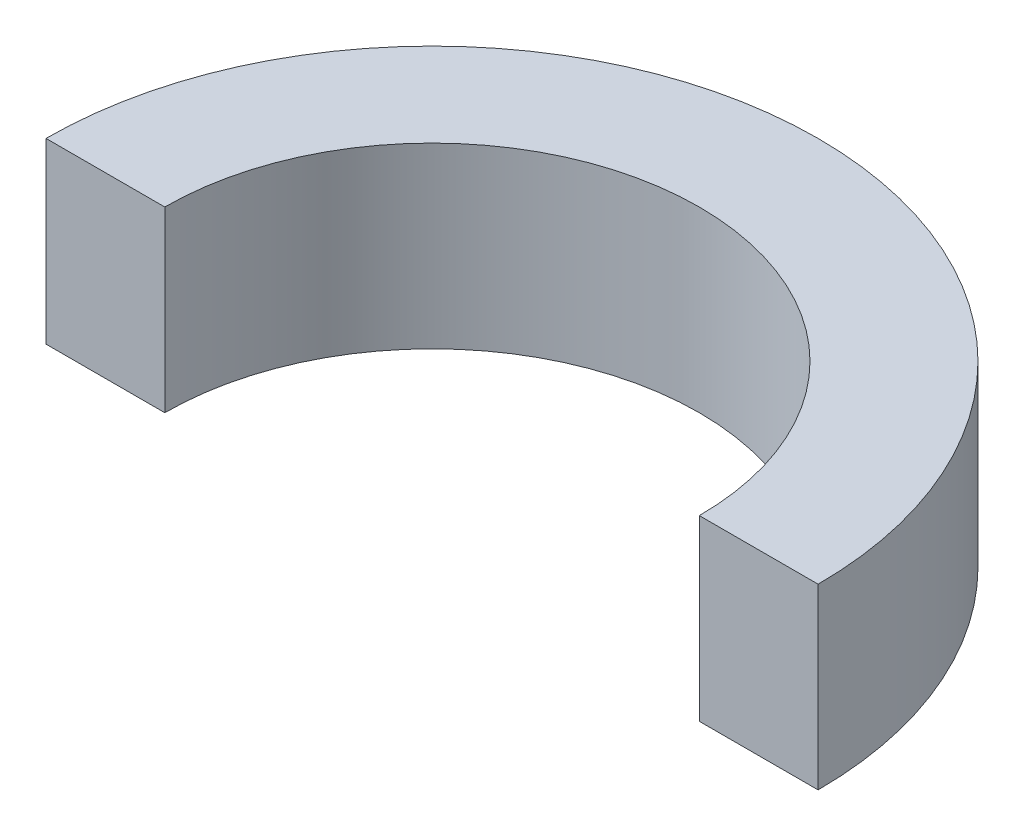
ISO-10303-21;
HEADER;
FILE_DESCRIPTION(('STEP AP214'),'2;1');
FILE_NAME('part.step','',(''),(''),'','','');
FILE_SCHEMA(('AUTOMOTIVE_DESIGN { 1 0 10303 214 1 1 1 1 }'));
ENDSEC;
DATA;
#1=APPLICATION_CONTEXT('core data for automotive mechanical design processes');
#2=APPLICATION_PROTOCOL_DEFINITION('international standard','automotive_design',2000,#1);
#3=PRODUCT_CONTEXT('',#1,'mechanical');
#4=PRODUCT('Part','Part','',(#3));
#5=PRODUCT_RELATED_PRODUCT_CATEGORY('part','',(#4));
#6=PRODUCT_DEFINITION_FORMATION('','',#4);
#7=PRODUCT_DEFINITION_CONTEXT('part definition',#1,'design');
#8=PRODUCT_DEFINITION('design','',#6,#7);
#9=PRODUCT_DEFINITION_SHAPE('','',#8);
#10=(LENGTH_UNIT() NAMED_UNIT(*) SI_UNIT(.MILLI.,.METRE.));
#11=(NAMED_UNIT(*) PLANE_ANGLE_UNIT() SI_UNIT($,.RADIAN.));
#12=(NAMED_UNIT(*) SI_UNIT($,.STERADIAN.) SOLID_ANGLE_UNIT());
#13=UNCERTAINTY_MEASURE_WITH_UNIT(LENGTH_MEASURE(1.E-05),#10,'distance_accuracy_value','');
#14=(GEOMETRIC_REPRESENTATION_CONTEXT(3) GLOBAL_UNCERTAINTY_ASSIGNED_CONTEXT((#13)) GLOBAL_UNIT_ASSIGNED_CONTEXT((#10,
#11,#12)) REPRESENTATION_CONTEXT('',''));
#15=CARTESIAN_POINT('',(0.,0.,0.));
#16=DIRECTION('',(0.,0.,1.));
#17=DIRECTION('',(1.,0.,0.));
#18=AXIS2_PLACEMENT_3D('',#15,#16,#17);
#19=CARTESIAN_POINT('',(0.,6.,0.));
#20=DIRECTION('',(0.,-1.,0.));
#21=DIRECTION('',(0.,0.,-1.));
#22=AXIS2_PLACEMENT_3D('',#19,#20,#21);
#23=CYLINDRICAL_SURFACE('',#22,9.);
#24=CARTESIAN_POINT('',(0.,0.,0.));
#25=DIRECTION('',(0.,-1.,0.));
#26=DIRECTION('',(0.,0.,1.));
#27=AXIS2_PLACEMENT_3D('',#24,#25,#26);
#28=CIRCLE('',#27,9.);
#29=CARTESIAN_POINT('',(-9.,0.,0.));
#30=VERTEX_POINT('',#29);
#31=CARTESIAN_POINT('',(9.,0.,0.));
#32=VERTEX_POINT('',#31);
#33=EDGE_CURVE('E107',#30,#32,#28,.T.);
#34=ORIENTED_EDGE('',*,*,#33,.T.);
#35=DIRECTION('',(0.,-1.,0.));
#36=VECTOR('',#35,1.);
#37=CARTESIAN_POINT('',(9.,6.,0.));
#38=LINE('',#37,#36);
#39=CARTESIAN_POINT('',(9.,6.,0.));
#40=VERTEX_POINT('',#39);
#41=EDGE_CURVE('E11',#40,#32,#38,.T.);
#42=ORIENTED_EDGE('',*,*,#41,.F.);
#43=CARTESIAN_POINT('',(0.,6.,0.));
#44=DIRECTION('',(0.,-1.,0.));
#45=DIRECTION('',(0.,0.,1.));
#46=AXIS2_PLACEMENT_3D('',#43,#44,#45);
#47=CIRCLE('',#46,9.);
#48=CARTESIAN_POINT('',(-9.,6.,0.));
#49=VERTEX_POINT('',#48);
#50=EDGE_CURVE('E91',#49,#40,#47,.T.);
#51=ORIENTED_EDGE('',*,*,#50,.F.);
#52=DIRECTION('',(0.,-1.,0.));
#53=VECTOR('',#52,1.);
#54=CARTESIAN_POINT('',(-9.,6.,0.));
#55=LINE('',#54,#53);
#56=EDGE_CURVE('E103',#49,#30,#55,.T.);
#57=ORIENTED_EDGE('',*,*,#56,.T.);
#58=EDGE_LOOP('',(#34,#42,#51,#57));
#59=FACE_BOUND('',#58,.T.);
#60=ADVANCED_FACE('F39',(#59),#23,.F.);
#61=CARTESIAN_POINT('',(9.,6.,0.));
#62=DIRECTION('',(0.,0.,-1.));
#63=DIRECTION('',(-1.,0.,0.));
#64=AXIS2_PLACEMENT_3D('',#61,#62,#63);
#65=PLANE('',#64);
#66=DIRECTION('',(1.,0.,0.));
#67=VECTOR('',#66,1.);
#68=CARTESIAN_POINT('',(9.,0.,0.));
#69=LINE('',#68,#67);
#70=CARTESIAN_POINT('',(13.,0.,0.));
#71=VERTEX_POINT('',#70);
#72=EDGE_CURVE('E96',#32,#71,#69,.T.);
#73=ORIENTED_EDGE('',*,*,#72,.T.);
#74=DIRECTION('',(0.,-1.,0.));
#75=VECTOR('',#74,1.);
#76=CARTESIAN_POINT('',(13.,6.,0.));
#77=LINE('',#76,#75);
#78=CARTESIAN_POINT('',(13.,6.,0.));
#79=VERTEX_POINT('',#78);
#80=EDGE_CURVE('E48',#79,#71,#77,.T.);
#81=ORIENTED_EDGE('',*,*,#80,.F.);
#82=DIRECTION('',(1.,0.,0.));
#83=VECTOR('',#82,1.);
#84=CARTESIAN_POINT('',(9.,6.,0.));
#85=LINE('',#84,#83);
#86=EDGE_CURVE('E86',#40,#79,#85,.T.);
#87=ORIENTED_EDGE('',*,*,#86,.F.);
#88=ORIENTED_EDGE('',*,*,#41,.T.);
#89=EDGE_LOOP('',(#73,#81,#87,#88));
#90=FACE_BOUND('',#89,.T.);
#91=ADVANCED_FACE('F95',(#90),#65,.F.);
#92=CARTESIAN_POINT('',(0.,6.,0.));
#93=DIRECTION('',(0.,-1.,0.));
#94=DIRECTION('',(0.,0.,-1.));
#95=AXIS2_PLACEMENT_3D('',#92,#93,#94);
#96=CYLINDRICAL_SURFACE('',#95,13.);
#97=CARTESIAN_POINT('',(0.,0.,0.));
#98=DIRECTION('',(0.,1.,0.));
#99=DIRECTION('',(0.,0.,1.));
#100=AXIS2_PLACEMENT_3D('',#97,#98,#99);
#101=CIRCLE('',#100,13.);
#102=CARTESIAN_POINT('',(-13.,0.,0.));
#103=VERTEX_POINT('',#102);
#104=EDGE_CURVE('E73',#71,#103,#101,.T.);
#105=ORIENTED_EDGE('',*,*,#104,.T.);
#106=DIRECTION('',(0.,-1.,0.));
#107=VECTOR('',#106,1.);
#108=CARTESIAN_POINT('',(-13.,6.,0.));
#109=LINE('',#108,#107);
#110=CARTESIAN_POINT('',(-13.,6.,0.));
#111=VERTEX_POINT('',#110);
#112=EDGE_CURVE('E98',#111,#103,#109,.T.);
#113=ORIENTED_EDGE('',*,*,#112,.F.);
#114=CARTESIAN_POINT('',(0.,6.,0.));
#115=DIRECTION('',(0.,1.,0.));
#116=DIRECTION('',(0.,0.,1.));
#117=AXIS2_PLACEMENT_3D('',#114,#115,#116);
#118=CIRCLE('',#117,13.);
#119=EDGE_CURVE('E89',#79,#111,#118,.T.);
#120=ORIENTED_EDGE('',*,*,#119,.F.);
#121=ORIENTED_EDGE('',*,*,#80,.T.);
#122=EDGE_LOOP('',(#105,#113,#120,#121));
#123=FACE_BOUND('',#122,.T.);
#124=ADVANCED_FACE('F99',(#123),#96,.T.);
#125=CARTESIAN_POINT('',(-13.,6.,0.));
#126=DIRECTION('',(0.,0.,-1.));
#127=DIRECTION('',(-1.,0.,0.));
#128=AXIS2_PLACEMENT_3D('',#125,#126,#127);
#129=PLANE('',#128);
#130=DIRECTION('',(1.,0.,0.));
#131=VECTOR('',#130,1.);
#132=CARTESIAN_POINT('',(-13.,0.,0.));
#133=LINE('',#132,#131);
#134=EDGE_CURVE('E79',#103,#30,#133,.T.);
#135=ORIENTED_EDGE('',*,*,#134,.T.);
#136=ORIENTED_EDGE('',*,*,#56,.F.);
#137=DIRECTION('',(1.,0.,0.));
#138=VECTOR('',#137,1.);
#139=CARTESIAN_POINT('',(-13.,6.,0.));
#140=LINE('',#139,#138);
#141=EDGE_CURVE('E56',#111,#49,#140,.T.);
#142=ORIENTED_EDGE('',*,*,#141,.F.);
#143=ORIENTED_EDGE('',*,*,#112,.T.);
#144=EDGE_LOOP('',(#135,#136,#142,#143));
#145=FACE_BOUND('',#144,.T.);
#146=ADVANCED_FACE('F120',(#145),#129,.F.);
#147=CARTESIAN_POINT('',(0.,6.,0.));
#148=DIRECTION('',(0.,1.,0.));
#149=DIRECTION('',(0.,0.,1.));
#150=AXIS2_PLACEMENT_3D('',#147,#148,#149);
#151=PLANE('',#150);
#152=ORIENTED_EDGE('',*,*,#50,.T.);
#153=ORIENTED_EDGE('',*,*,#86,.T.);
#154=ORIENTED_EDGE('',*,*,#119,.T.);
#155=ORIENTED_EDGE('',*,*,#141,.T.);
#156=EDGE_LOOP('',(#152,#153,#154,#155));
#157=FACE_BOUND('',#156,.T.);
#158=ADVANCED_FACE('F87',(#157),#151,.T.);
#159=CARTESIAN_POINT('',(0.,0.,0.));
#160=DIRECTION('',(0.,1.,0.));
#161=DIRECTION('',(0.,0.,1.));
#162=AXIS2_PLACEMENT_3D('',#159,#160,#161);
#163=PLANE('',#162);
#164=ORIENTED_EDGE('',*,*,#33,.F.);
#165=ORIENTED_EDGE('',*,*,#134,.F.);
#166=ORIENTED_EDGE('',*,*,#104,.F.);
#167=ORIENTED_EDGE('',*,*,#72,.F.);
#168=EDGE_LOOP('',(#164,#165,#166,#167));
#169=FACE_BOUND('',#168,.T.);
#170=ADVANCED_FACE('F123',(#169),#163,.F.);
#171=CLOSED_SHELL('',(#60,#91,#124,#146,#158,#170));
#172=MANIFOLD_SOLID_BREP('B2',#171);
#173=ADVANCED_BREP_SHAPE_REPRESENTATION('',(#18,#172),#14);
#174=SHAPE_DEFINITION_REPRESENTATION(#9,#173);
ENDSEC;
END-ISO-10303-21;
